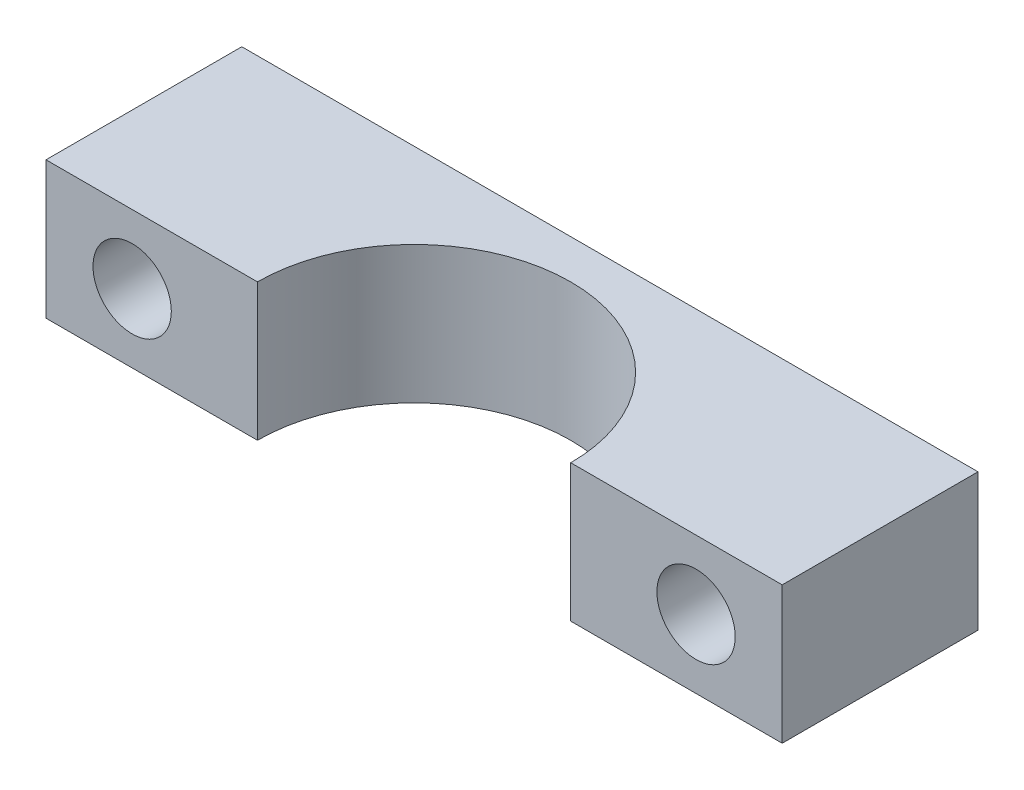
ISO-10303-21;
HEADER;
FILE_DESCRIPTION(('STEP AP214'),'2;1');
FILE_NAME('part.step','',(''),(''),'','','');
FILE_SCHEMA(('AUTOMOTIVE_DESIGN { 1 0 10303 214 1 1 1 1 }'));
ENDSEC;
DATA;
#1=APPLICATION_CONTEXT('core data for automotive mechanical design processes');
#2=APPLICATION_PROTOCOL_DEFINITION('international standard','automotive_design',2000,#1);
#3=PRODUCT_CONTEXT('',#1,'mechanical');
#4=PRODUCT('Part','Part','',(#3));
#5=PRODUCT_RELATED_PRODUCT_CATEGORY('part','',(#4));
#6=PRODUCT_DEFINITION_FORMATION('','',#4);
#7=PRODUCT_DEFINITION_CONTEXT('part definition',#1,'design');
#8=PRODUCT_DEFINITION('design','',#6,#7);
#9=PRODUCT_DEFINITION_SHAPE('','',#8);
#10=(LENGTH_UNIT() NAMED_UNIT(*) SI_UNIT(.MILLI.,.METRE.));
#11=(NAMED_UNIT(*) PLANE_ANGLE_UNIT() SI_UNIT($,.RADIAN.));
#12=(NAMED_UNIT(*) SI_UNIT($,.STERADIAN.) SOLID_ANGLE_UNIT());
#13=UNCERTAINTY_MEASURE_WITH_UNIT(LENGTH_MEASURE(1.E-05),#10,'distance_accuracy_value','');
#14=(GEOMETRIC_REPRESENTATION_CONTEXT(3) GLOBAL_UNCERTAINTY_ASSIGNED_CONTEXT((#13)) GLOBAL_UNIT_ASSIGNED_CONTEXT((#10,
#11,#12)) REPRESENTATION_CONTEXT('',''));
#15=CARTESIAN_POINT('',(0.,0.,0.));
#16=DIRECTION('',(0.,0.,1.));
#17=DIRECTION('',(1.,0.,0.));
#18=AXIS2_PLACEMENT_3D('',#15,#16,#17);
#19=CARTESIAN_POINT('',(0.,5.5626,0.));
#20=DIRECTION('',(0.,-1.,0.));
#21=DIRECTION('',(0.,0.,-1.));
#22=AXIS2_PLACEMENT_3D('',#19,#20,#21);
#23=CYLINDRICAL_SURFACE('',#22,12.7);
#24=CARTESIAN_POINT('',(0.,-5.5626,0.));
#25=DIRECTION('',(0.,-1.,0.));
#26=DIRECTION('',(0.,0.,-1.));
#27=AXIS2_PLACEMENT_3D('',#24,#25,#26);
#28=CIRCLE('',#27,12.7);
#29=CARTESIAN_POINT('',(-12.7,-5.5626,0.));
#30=VERTEX_POINT('',#29);
#31=CARTESIAN_POINT('',(12.7,-5.5626,0.));
#32=VERTEX_POINT('',#31);
#33=EDGE_CURVE('E120',#30,#32,#28,.T.);
#34=ORIENTED_EDGE('',*,*,#33,.T.);
#35=DIRECTION('',(0.,-1.,0.));
#36=VECTOR('',#35,1.);
#37=CARTESIAN_POINT('',(12.7,5.5626,0.));
#38=LINE('',#37,#36);
#39=CARTESIAN_POINT('',(12.7,5.5626,0.));
#40=VERTEX_POINT('',#39);
#41=EDGE_CURVE('E11',#40,#32,#38,.T.);
#42=ORIENTED_EDGE('',*,*,#41,.F.);
#43=CARTESIAN_POINT('',(0.,5.5626,0.));
#44=DIRECTION('',(0.,-1.,0.));
#45=DIRECTION('',(0.,0.,-1.));
#46=AXIS2_PLACEMENT_3D('',#43,#44,#45);
#47=CIRCLE('',#46,12.7);
#48=CARTESIAN_POINT('',(-12.7,5.5626,0.));
#49=VERTEX_POINT('',#48);
#50=EDGE_CURVE('E131',#49,#40,#47,.T.);
#51=ORIENTED_EDGE('',*,*,#50,.F.);
#52=DIRECTION('',(0.,-1.,0.));
#53=VECTOR('',#52,1.);
#54=CARTESIAN_POINT('',(-12.7,5.5626,0.));
#55=LINE('',#54,#53);
#56=EDGE_CURVE('E116',#49,#30,#55,.T.);
#57=ORIENTED_EDGE('',*,*,#56,.T.);
#58=EDGE_LOOP('',(#34,#42,#51,#57));
#59=FACE_BOUND('',#58,.T.);
#60=ADVANCED_FACE('F36',(#59),#23,.F.);
#61=CARTESIAN_POINT('',(29.845,5.5626,0.));
#62=DIRECTION('',(0.,0.,-1.));
#63=DIRECTION('',(-1.,0.,0.));
#64=AXIS2_PLACEMENT_3D('',#61,#62,#63);
#65=PLANE('',#64);
#66=CARTESIAN_POINT('',(22.86,0.,0.));
#67=DIRECTION('',(0.,0.,1.));
#68=DIRECTION('',(1.,0.,0.));
#69=AXIS2_PLACEMENT_3D('',#66,#67,#68);
#70=CIRCLE('',#69,3.175);
#71=CARTESIAN_POINT('',(26.035,0.,0.));
#72=VERTEX_POINT('',#71);
#73=EDGE_CURVE('E180',#72,#72,#70,.T.);
#74=ORIENTED_EDGE('',*,*,#73,.F.);
#75=EDGE_LOOP('',(#74));
#76=FACE_BOUND('',#75,.T.);
#77=DIRECTION('',(1.,0.,0.));
#78=VECTOR('',#77,1.);
#79=CARTESIAN_POINT('',(29.845,-5.5626,0.));
#80=LINE('',#79,#78);
#81=CARTESIAN_POINT('',(29.845,-5.5626,0.));
#82=VERTEX_POINT('',#81);
#83=EDGE_CURVE('E123',#32,#82,#80,.T.);
#84=ORIENTED_EDGE('',*,*,#83,.T.);
#85=DIRECTION('',(0.,-1.,0.));
#86=VECTOR('',#85,1.);
#87=CARTESIAN_POINT('',(29.845,5.5626,0.));
#88=LINE('',#87,#86);
#89=CARTESIAN_POINT('',(29.845,5.5626,0.));
#90=VERTEX_POINT('',#89);
#91=EDGE_CURVE('E44',#90,#82,#88,.T.);
#92=ORIENTED_EDGE('',*,*,#91,.F.);
#93=DIRECTION('',(1.,0.,0.));
#94=VECTOR('',#93,1.);
#95=CARTESIAN_POINT('',(29.845,5.5626,0.));
#96=LINE('',#95,#94);
#97=EDGE_CURVE('E89',#40,#90,#96,.T.);
#98=ORIENTED_EDGE('',*,*,#97,.F.);
#99=ORIENTED_EDGE('',*,*,#41,.T.);
#100=EDGE_LOOP('',(#84,#92,#98,#99));
#101=FACE_BOUND('',#100,.T.);
#102=ADVANCED_FACE('F157',(#76,#101),#65,.F.);
#103=CARTESIAN_POINT('',(29.845,5.5626,-15.875));
#104=DIRECTION('',(-1.,0.,0.));
#105=DIRECTION('',(0.,0.,1.));
#106=AXIS2_PLACEMENT_3D('',#103,#104,#105);
#107=PLANE('',#106);
#108=DIRECTION('',(0.,0.,-1.));
#109=VECTOR('',#108,1.);
#110=CARTESIAN_POINT('',(29.845,-5.5626,-15.875));
#111=LINE('',#110,#109);
#112=CARTESIAN_POINT('',(29.845,-5.5626,-15.875));
#113=VERTEX_POINT('',#112);
#114=EDGE_CURVE('E126',#82,#113,#111,.T.);
#115=ORIENTED_EDGE('',*,*,#114,.T.);
#116=DIRECTION('',(0.,-1.,0.));
#117=VECTOR('',#116,1.);
#118=CARTESIAN_POINT('',(29.845,5.5626,-15.875));
#119=LINE('',#118,#117);
#120=CARTESIAN_POINT('',(29.845,5.5626,-15.875));
#121=VERTEX_POINT('',#120);
#122=EDGE_CURVE('E111',#121,#113,#119,.T.);
#123=ORIENTED_EDGE('',*,*,#122,.F.);
#124=DIRECTION('',(0.,0.,-1.));
#125=VECTOR('',#124,1.);
#126=CARTESIAN_POINT('',(29.845,5.5626,-15.875));
#127=LINE('',#126,#125);
#128=EDGE_CURVE('E102',#90,#121,#127,.T.);
#129=ORIENTED_EDGE('',*,*,#128,.F.);
#130=ORIENTED_EDGE('',*,*,#91,.T.);
#131=EDGE_LOOP('',(#115,#123,#129,#130));
#132=FACE_BOUND('',#131,.T.);
#133=ADVANCED_FACE('F137',(#132),#107,.F.);
#134=CARTESIAN_POINT('',(-29.845,5.5626,-15.875));
#135=DIRECTION('',(0.,0.,1.));
#136=DIRECTION('',(1.,0.,0.));
#137=AXIS2_PLACEMENT_3D('',#134,#135,#136);
#138=PLANE('',#137);
#139=CARTESIAN_POINT('',(-22.86,0.,-15.875));
#140=DIRECTION('',(0.,0.,1.));
#141=DIRECTION('',(1.,0.,0.));
#142=AXIS2_PLACEMENT_3D('',#139,#140,#141);
#143=CIRCLE('',#142,3.175);
#144=CARTESIAN_POINT('',(-19.685,0.,-15.875));
#145=VERTEX_POINT('',#144);
#146=EDGE_CURVE('E124',#145,#145,#143,.T.);
#147=ORIENTED_EDGE('',*,*,#146,.T.);
#148=EDGE_LOOP('',(#147));
#149=FACE_BOUND('',#148,.T.);
#150=CARTESIAN_POINT('',(22.86,0.,-15.875));
#151=DIRECTION('',(0.,0.,1.));
#152=DIRECTION('',(1.,0.,0.));
#153=AXIS2_PLACEMENT_3D('',#150,#151,#152);
#154=CIRCLE('',#153,3.175);
#155=CARTESIAN_POINT('',(26.035,0.,-15.875));
#156=VERTEX_POINT('',#155);
#157=EDGE_CURVE('E177',#156,#156,#154,.T.);
#158=ORIENTED_EDGE('',*,*,#157,.T.);
#159=EDGE_LOOP('',(#158));
#160=FACE_BOUND('',#159,.T.);
#161=DIRECTION('',(-1.,0.,0.));
#162=VECTOR('',#161,1.);
#163=CARTESIAN_POINT('',(-29.845,-5.5626,-15.875));
#164=LINE('',#163,#162);
#165=CARTESIAN_POINT('',(-29.845,-5.5626,-15.875));
#166=VERTEX_POINT('',#165);
#167=EDGE_CURVE('E110',#113,#166,#164,.T.);
#168=ORIENTED_EDGE('',*,*,#167,.T.);
#169=DIRECTION('',(0.,-1.,0.));
#170=VECTOR('',#169,1.);
#171=CARTESIAN_POINT('',(-29.845,5.5626,-15.875));
#172=LINE('',#171,#170);
#173=CARTESIAN_POINT('',(-29.845,5.5626,-15.875));
#174=VERTEX_POINT('',#173);
#175=EDGE_CURVE('E107',#174,#166,#172,.T.);
#176=ORIENTED_EDGE('',*,*,#175,.F.);
#177=DIRECTION('',(-1.,0.,0.));
#178=VECTOR('',#177,1.);
#179=CARTESIAN_POINT('',(-29.845,5.5626,-15.875));
#180=LINE('',#179,#178);
#181=EDGE_CURVE('E96',#121,#174,#180,.T.);
#182=ORIENTED_EDGE('',*,*,#181,.F.);
#183=ORIENTED_EDGE('',*,*,#122,.T.);
#184=EDGE_LOOP('',(#168,#176,#182,#183));
#185=FACE_BOUND('',#184,.T.);
#186=ADVANCED_FACE('F108',(#149,#160,#185),#138,.F.);
#187=CARTESIAN_POINT('',(-29.845,5.5626,0.));
#188=DIRECTION('',(1.,0.,0.));
#189=DIRECTION('',(0.,0.,-1.));
#190=AXIS2_PLACEMENT_3D('',#187,#188,#189);
#191=PLANE('',#190);
#192=DIRECTION('',(0.,0.,1.));
#193=VECTOR('',#192,1.);
#194=CARTESIAN_POINT('',(-29.845,-5.5626,0.));
#195=LINE('',#194,#193);
#196=CARTESIAN_POINT('',(-29.845,-5.5626,0.));
#197=VERTEX_POINT('',#196);
#198=EDGE_CURVE('E75',#166,#197,#195,.T.);
#199=ORIENTED_EDGE('',*,*,#198,.T.);
#200=DIRECTION('',(0.,-1.,0.));
#201=VECTOR('',#200,1.);
#202=CARTESIAN_POINT('',(-29.845,5.5626,0.));
#203=LINE('',#202,#201);
#204=CARTESIAN_POINT('',(-29.845,5.5626,0.));
#205=VERTEX_POINT('',#204);
#206=EDGE_CURVE('E112',#205,#197,#203,.T.);
#207=ORIENTED_EDGE('',*,*,#206,.F.);
#208=DIRECTION('',(0.,0.,1.));
#209=VECTOR('',#208,1.);
#210=CARTESIAN_POINT('',(-29.845,5.5626,0.));
#211=LINE('',#210,#209);
#212=EDGE_CURVE('E100',#174,#205,#211,.T.);
#213=ORIENTED_EDGE('',*,*,#212,.F.);
#214=ORIENTED_EDGE('',*,*,#175,.T.);
#215=EDGE_LOOP('',(#199,#207,#213,#214));
#216=FACE_BOUND('',#215,.T.);
#217=ADVANCED_FACE('F114',(#216),#191,.F.);
#218=CARTESIAN_POINT('',(-12.7,5.5626,0.));
#219=DIRECTION('',(0.,0.,-1.));
#220=DIRECTION('',(-1.,0.,0.));
#221=AXIS2_PLACEMENT_3D('',#218,#219,#220);
#222=PLANE('',#221);
#223=CARTESIAN_POINT('',(-22.86,0.,0.));
#224=DIRECTION('',(0.,0.,1.));
#225=DIRECTION('',(1.,0.,0.));
#226=AXIS2_PLACEMENT_3D('',#223,#224,#225);
#227=CIRCLE('',#226,3.175);
#228=CARTESIAN_POINT('',(-19.685,0.,0.));
#229=VERTEX_POINT('',#228);
#230=EDGE_CURVE('E179',#229,#229,#227,.T.);
#231=ORIENTED_EDGE('',*,*,#230,.F.);
#232=EDGE_LOOP('',(#231));
#233=FACE_BOUND('',#232,.T.);
#234=DIRECTION('',(1.,0.,0.));
#235=VECTOR('',#234,1.);
#236=CARTESIAN_POINT('',(-12.7,-5.5626,0.));
#237=LINE('',#236,#235);
#238=EDGE_CURVE('E81',#197,#30,#237,.T.);
#239=ORIENTED_EDGE('',*,*,#238,.T.);
#240=ORIENTED_EDGE('',*,*,#56,.F.);
#241=DIRECTION('',(1.,0.,0.));
#242=VECTOR('',#241,1.);
#243=CARTESIAN_POINT('',(-12.7,5.5626,0.));
#244=LINE('',#243,#242);
#245=EDGE_CURVE('E52',#205,#49,#244,.T.);
#246=ORIENTED_EDGE('',*,*,#245,.F.);
#247=ORIENTED_EDGE('',*,*,#206,.T.);
#248=EDGE_LOOP('',(#239,#240,#246,#247));
#249=FACE_BOUND('',#248,.T.);
#250=ADVANCED_FACE('F144',(#233,#249),#222,.F.);
#251=CARTESIAN_POINT('',(0.,5.5626,0.));
#252=DIRECTION('',(0.,-1.,0.));
#253=DIRECTION('',(0.,0.,-1.));
#254=AXIS2_PLACEMENT_3D('',#251,#252,#253);
#255=PLANE('',#254);
#256=ORIENTED_EDGE('',*,*,#50,.T.);
#257=ORIENTED_EDGE('',*,*,#97,.T.);
#258=ORIENTED_EDGE('',*,*,#128,.T.);
#259=ORIENTED_EDGE('',*,*,#181,.T.);
#260=ORIENTED_EDGE('',*,*,#212,.T.);
#261=ORIENTED_EDGE('',*,*,#245,.T.);
#262=EDGE_LOOP('',(#256,#257,#258,#259,#260,#261));
#263=FACE_BOUND('',#262,.T.);
#264=ADVANCED_FACE('F98',(#263),#255,.F.);
#265=CARTESIAN_POINT('',(0.,-5.5626,0.));
#266=DIRECTION('',(0.,-1.,0.));
#267=DIRECTION('',(0.,0.,-1.));
#268=AXIS2_PLACEMENT_3D('',#265,#266,#267);
#269=PLANE('',#268);
#270=ORIENTED_EDGE('',*,*,#33,.F.);
#271=ORIENTED_EDGE('',*,*,#238,.F.);
#272=ORIENTED_EDGE('',*,*,#198,.F.);
#273=ORIENTED_EDGE('',*,*,#167,.F.);
#274=ORIENTED_EDGE('',*,*,#114,.F.);
#275=ORIENTED_EDGE('',*,*,#83,.F.);
#276=EDGE_LOOP('',(#270,#271,#272,#273,#274,#275));
#277=FACE_BOUND('',#276,.T.);
#278=ADVANCED_FACE('F140',(#277),#269,.T.);
#279=CARTESIAN_POINT('',(-22.86,0.,-15.875));
#280=DIRECTION('',(0.,0.,1.));
#281=DIRECTION('',(1.,0.,0.));
#282=AXIS2_PLACEMENT_3D('',#279,#280,#281);
#283=CYLINDRICAL_SURFACE('',#282,3.175);
#284=ORIENTED_EDGE('',*,*,#146,.F.);
#285=EDGE_LOOP('',(#284));
#286=FACE_BOUND('',#285,.T.);
#287=ORIENTED_EDGE('',*,*,#230,.T.);
#288=EDGE_LOOP('',(#287));
#289=FACE_BOUND('',#288,.T.);
#290=ADVANCED_FACE('F192',(#286,#289),#283,.F.);
#291=CARTESIAN_POINT('',(22.86,0.,-15.875));
#292=DIRECTION('',(0.,0.,1.));
#293=DIRECTION('',(1.,0.,0.));
#294=AXIS2_PLACEMENT_3D('',#291,#292,#293);
#295=CYLINDRICAL_SURFACE('',#294,3.175);
#296=ORIENTED_EDGE('',*,*,#157,.F.);
#297=EDGE_LOOP('',(#296));
#298=FACE_BOUND('',#297,.T.);
#299=ORIENTED_EDGE('',*,*,#73,.T.);
#300=EDGE_LOOP('',(#299));
#301=FACE_BOUND('',#300,.T.);
#302=ADVANCED_FACE('F190',(#298,#301),#295,.F.);
#303=CLOSED_SHELL('',(#60,#102,#133,#186,#217,#250,#264,#278,#290,#302));
#304=MANIFOLD_SOLID_BREP('B2',#303);
#305=ADVANCED_BREP_SHAPE_REPRESENTATION('',(#18,#304),#14);
#306=SHAPE_DEFINITION_REPRESENTATION(#9,#305);
ENDSEC;
END-ISO-10303-21;
